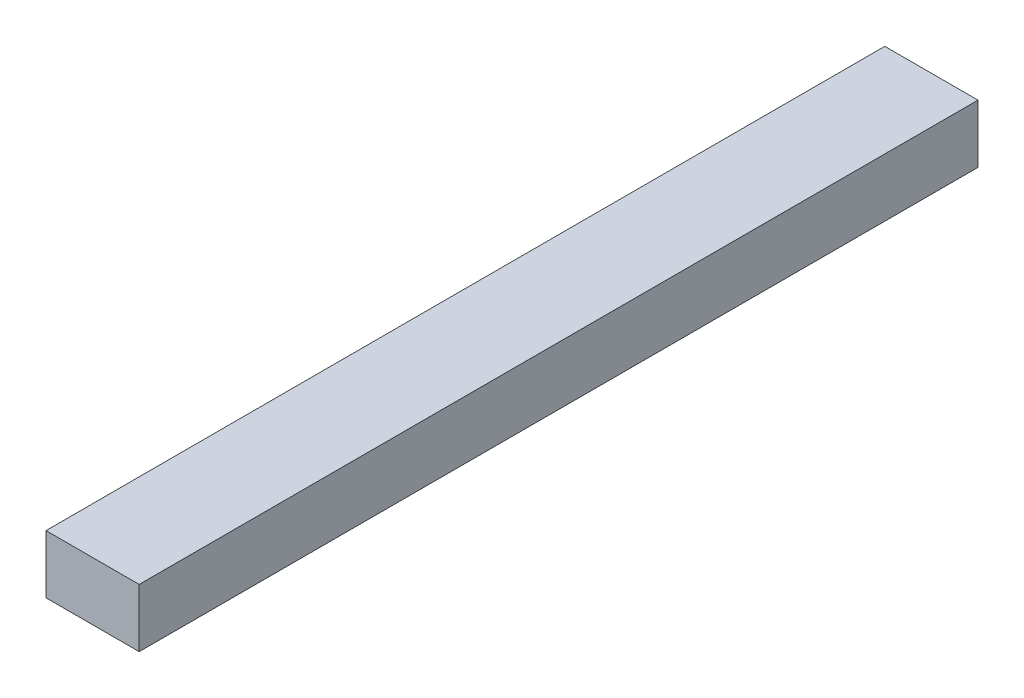
ISO-10303-21;
HEADER;
FILE_DESCRIPTION(('STEP AP214'),'2;1');
FILE_NAME('part.step','',(''),(''),'','','');
FILE_SCHEMA(('AUTOMOTIVE_DESIGN { 1 0 10303 214 1 1 1 1 }'));
ENDSEC;
DATA;
#1=APPLICATION_CONTEXT('core data for automotive mechanical design processes');
#2=APPLICATION_PROTOCOL_DEFINITION('international standard','automotive_design',2000,#1);
#3=PRODUCT_CONTEXT('',#1,'mechanical');
#4=PRODUCT('Part','Part','',(#3));
#5=PRODUCT_RELATED_PRODUCT_CATEGORY('part','',(#4));
#6=PRODUCT_DEFINITION_FORMATION('','',#4);
#7=PRODUCT_DEFINITION_CONTEXT('part definition',#1,'design');
#8=PRODUCT_DEFINITION('design','',#6,#7);
#9=PRODUCT_DEFINITION_SHAPE('','',#8);
#10=(LENGTH_UNIT() NAMED_UNIT(*) SI_UNIT(.MILLI.,.METRE.));
#11=(NAMED_UNIT(*) PLANE_ANGLE_UNIT() SI_UNIT($,.RADIAN.));
#12=(NAMED_UNIT(*) SI_UNIT($,.STERADIAN.) SOLID_ANGLE_UNIT());
#13=UNCERTAINTY_MEASURE_WITH_UNIT(LENGTH_MEASURE(1.E-05),#10,'distance_accuracy_value','');
#14=(GEOMETRIC_REPRESENTATION_CONTEXT(3) GLOBAL_UNCERTAINTY_ASSIGNED_CONTEXT((#13)) GLOBAL_UNIT_ASSIGNED_CONTEXT((#10,
#11,#12)) REPRESENTATION_CONTEXT('',''));
#15=CARTESIAN_POINT('',(0.,0.,0.));
#16=DIRECTION('',(0.,0.,1.));
#17=DIRECTION('',(1.,0.,0.));
#18=AXIS2_PLACEMENT_3D('',#15,#16,#17);
#19=CARTESIAN_POINT('',(-12.7,-7.93749999999994,114.3));
#20=DIRECTION('',(1.,0.,0.));
#21=DIRECTION('',(0.,0.,-1.));
#22=AXIS2_PLACEMENT_3D('',#19,#20,#21);
#23=PLANE('',#22);
#24=DIRECTION('',(0.,-1.,0.));
#25=VECTOR('',#24,1.);
#26=CARTESIAN_POINT('',(-12.7,-7.93750000000001,-114.3));
#27=LINE('',#26,#25);
#28=CARTESIAN_POINT('',(-12.7,7.93749999999998,-114.3));
#29=VERTEX_POINT('',#28);
#30=CARTESIAN_POINT('',(-12.7,-7.93750000000001,-114.3));
#31=VERTEX_POINT('',#30);
#32=EDGE_CURVE('E111',#29,#31,#27,.T.);
#33=ORIENTED_EDGE('',*,*,#32,.T.);
#34=DIRECTION('',(0.,0.,-1.));
#35=VECTOR('',#34,1.);
#36=CARTESIAN_POINT('',(-12.7,-7.93749999999994,114.3));
#37=LINE('',#36,#35);
#38=CARTESIAN_POINT('',(-12.7,-7.93749999999994,114.3));
#39=VERTEX_POINT('',#38);
#40=EDGE_CURVE('E13',#39,#31,#37,.T.);
#41=ORIENTED_EDGE('',*,*,#40,.F.);
#42=DIRECTION('',(0.,-1.,0.));
#43=VECTOR('',#42,1.);
#44=CARTESIAN_POINT('',(-12.7,-7.93749999999994,114.3));
#45=LINE('',#44,#43);
#46=CARTESIAN_POINT('',(-12.7,7.93750000000002,114.3));
#47=VERTEX_POINT('',#46);
#48=EDGE_CURVE('E99',#47,#39,#45,.T.);
#49=ORIENTED_EDGE('',*,*,#48,.F.);
#50=DIRECTION('',(0.,0.,-1.));
#51=VECTOR('',#50,1.);
#52=CARTESIAN_POINT('',(-12.7,7.93750000000002,114.3));
#53=LINE('',#52,#51);
#54=EDGE_CURVE('E107',#47,#29,#53,.T.);
#55=ORIENTED_EDGE('',*,*,#54,.T.);
#56=EDGE_LOOP('',(#33,#41,#49,#55));
#57=FACE_BOUND('',#56,.T.);
#58=ADVANCED_FACE('F48',(#57),#23,.F.);
#59=CARTESIAN_POINT('',(12.7,-7.93749999999994,114.3));
#60=DIRECTION('',(0.,1.,0.));
#61=DIRECTION('',(-1.,0.,0.));
#62=AXIS2_PLACEMENT_3D('',#59,#60,#61);
#63=PLANE('',#62);
#64=DIRECTION('',(1.,0.,0.));
#65=VECTOR('',#64,1.);
#66=CARTESIAN_POINT('',(12.7,-7.93750000000001,-114.3));
#67=LINE('',#66,#65);
#68=CARTESIAN_POINT('',(12.7,-7.93750000000001,-114.3));
#69=VERTEX_POINT('',#68);
#70=EDGE_CURVE('E103',#31,#69,#67,.T.);
#71=ORIENTED_EDGE('',*,*,#70,.T.);
#72=DIRECTION('',(0.,0.,-1.));
#73=VECTOR('',#72,1.);
#74=CARTESIAN_POINT('',(12.7,-7.93749999999994,114.3));
#75=LINE('',#74,#73);
#76=CARTESIAN_POINT('',(12.7,-7.93749999999994,114.3));
#77=VERTEX_POINT('',#76);
#78=EDGE_CURVE('E56',#77,#69,#75,.T.);
#79=ORIENTED_EDGE('',*,*,#78,.F.);
#80=DIRECTION('',(1.,0.,0.));
#81=VECTOR('',#80,1.);
#82=CARTESIAN_POINT('',(12.7,-7.93749999999994,114.3));
#83=LINE('',#82,#81);
#84=EDGE_CURVE('E94',#39,#77,#83,.T.);
#85=ORIENTED_EDGE('',*,*,#84,.F.);
#86=ORIENTED_EDGE('',*,*,#40,.T.);
#87=EDGE_LOOP('',(#71,#79,#85,#86));
#88=FACE_BOUND('',#87,.T.);
#89=ADVANCED_FACE('F102',(#88),#63,.F.);
#90=CARTESIAN_POINT('',(12.7,-7.93749999999994,114.3));
#91=DIRECTION('',(-1.,0.,0.));
#92=DIRECTION('',(0.,0.,1.));
#93=AXIS2_PLACEMENT_3D('',#90,#91,#92);
#94=PLANE('',#93);
#95=DIRECTION('',(0.,1.,0.));
#96=VECTOR('',#95,1.);
#97=CARTESIAN_POINT('',(12.7,-7.93750000000001,-114.3));
#98=LINE('',#97,#96);
#99=CARTESIAN_POINT('',(12.7,7.93749999999999,-114.3));
#100=VERTEX_POINT('',#99);
#101=EDGE_CURVE('E81',#69,#100,#98,.T.);
#102=ORIENTED_EDGE('',*,*,#101,.T.);
#103=DIRECTION('',(0.,0.,-1.));
#104=VECTOR('',#103,1.);
#105=CARTESIAN_POINT('',(12.7,7.93750000000003,114.3));
#106=LINE('',#105,#104);
#107=CARTESIAN_POINT('',(12.7,7.93750000000003,114.3));
#108=VERTEX_POINT('',#107);
#109=EDGE_CURVE('E104',#108,#100,#106,.T.);
#110=ORIENTED_EDGE('',*,*,#109,.F.);
#111=DIRECTION('',(0.,1.,0.));
#112=VECTOR('',#111,1.);
#113=CARTESIAN_POINT('',(12.7,-7.93749999999994,114.3));
#114=LINE('',#113,#112);
#115=EDGE_CURVE('E97',#77,#108,#114,.T.);
#116=ORIENTED_EDGE('',*,*,#115,.F.);
#117=ORIENTED_EDGE('',*,*,#78,.T.);
#118=EDGE_LOOP('',(#102,#110,#116,#117));
#119=FACE_BOUND('',#118,.T.);
#120=ADVANCED_FACE('F105',(#119),#94,.F.);
#121=CARTESIAN_POINT('',(12.7,7.93750000000003,114.3));
#122=DIRECTION('',(0.,-1.,0.));
#123=DIRECTION('',(1.,0.,0.));
#124=AXIS2_PLACEMENT_3D('',#121,#122,#123);
#125=PLANE('',#124);
#126=DIRECTION('',(-1.,0.,0.));
#127=VECTOR('',#126,1.);
#128=CARTESIAN_POINT('',(12.7,7.93749999999999,-114.3));
#129=LINE('',#128,#127);
#130=EDGE_CURVE('E87',#100,#29,#129,.T.);
#131=ORIENTED_EDGE('',*,*,#130,.T.);
#132=ORIENTED_EDGE('',*,*,#54,.F.);
#133=DIRECTION('',(-1.,0.,0.));
#134=VECTOR('',#133,1.);
#135=CARTESIAN_POINT('',(12.7,7.93750000000003,114.3));
#136=LINE('',#135,#134);
#137=EDGE_CURVE('E64',#108,#47,#136,.T.);
#138=ORIENTED_EDGE('',*,*,#137,.F.);
#139=ORIENTED_EDGE('',*,*,#109,.T.);
#140=EDGE_LOOP('',(#131,#132,#138,#139));
#141=FACE_BOUND('',#140,.T.);
#142=ADVANCED_FACE('F119',(#141),#125,.F.);
#143=CARTESIAN_POINT('',(0.,0.,114.3));
#144=DIRECTION('',(0.,0.,1.));
#145=DIRECTION('',(1.,0.,0.));
#146=AXIS2_PLACEMENT_3D('',#143,#144,#145);
#147=PLANE('',#146);
#148=ORIENTED_EDGE('',*,*,#48,.T.);
#149=ORIENTED_EDGE('',*,*,#84,.T.);
#150=ORIENTED_EDGE('',*,*,#115,.T.);
#151=ORIENTED_EDGE('',*,*,#137,.T.);
#152=EDGE_LOOP('',(#148,#149,#150,#151));
#153=FACE_BOUND('',#152,.T.);
#154=ADVANCED_FACE('F95',(#153),#147,.T.);
#155=CARTESIAN_POINT('',(0.,0.,-114.3));
#156=DIRECTION('',(0.,0.,1.));
#157=DIRECTION('',(1.,0.,0.));
#158=AXIS2_PLACEMENT_3D('',#155,#156,#157);
#159=PLANE('',#158);
#160=CARTESIAN_POINT('',(0.,0.,-114.3));
#161=DIRECTION('',(0.,0.,-1.));
#162=DIRECTION('',(-1.,0.,0.));
#163=AXIS2_PLACEMENT_3D('',#160,#161,#162);
#164=CIRCLE('',#163,5.35813);
#165=CARTESIAN_POINT('',(-5.35813,0.,-114.3));
#166=VERTEX_POINT('',#165);
#167=EDGE_CURVE('E127',#166,#166,#164,.T.);
#168=ORIENTED_EDGE('',*,*,#167,.F.);
#169=EDGE_LOOP('',(#168));
#170=FACE_BOUND('',#169,.T.);
#171=ORIENTED_EDGE('',*,*,#32,.F.);
#172=ORIENTED_EDGE('',*,*,#130,.F.);
#173=ORIENTED_EDGE('',*,*,#101,.F.);
#174=ORIENTED_EDGE('',*,*,#70,.F.);
#175=EDGE_LOOP('',(#171,#172,#173,#174));
#176=FACE_BOUND('',#175,.T.);
#177=ADVANCED_FACE('F122',(#170,#176),#159,.F.);
#178=CARTESIAN_POINT('',(0.,0.,-83.058));
#179=DIRECTION('',(0.,0.,1.));
#180=DIRECTION('',(1.,0.,0.));
#181=AXIS2_PLACEMENT_3D('',#178,#179,#180);
#182=PLANE('',#181);
#183=CARTESIAN_POINT('',(0.,0.,-83.058));
#184=DIRECTION('',(0.,0.,-1.));
#185=DIRECTION('',(-1.,0.,0.));
#186=AXIS2_PLACEMENT_3D('',#183,#184,#185);
#187=CIRCLE('',#186,5.35812999999999);
#188=CARTESIAN_POINT('',(-5.35813000000001,0.,-83.058));
#189=VERTEX_POINT('',#188);
#190=EDGE_CURVE('E114',#189,#189,#187,.T.);
#191=ORIENTED_EDGE('',*,*,#190,.T.);
#192=EDGE_LOOP('',(#191));
#193=FACE_BOUND('',#192,.T.);
#194=ADVANCED_FACE('F134',(#193),#182,.F.);
#195=CARTESIAN_POINT('',(0.,0.,-114.3));
#196=DIRECTION('',(0.,0.,-1.));
#197=DIRECTION('',(-1.,0.,0.));
#198=AXIS2_PLACEMENT_3D('',#195,#196,#197);
#199=CYLINDRICAL_SURFACE('',#198,5.35813);
#200=ORIENTED_EDGE('',*,*,#190,.F.);
#201=EDGE_LOOP('',(#200));
#202=FACE_BOUND('',#201,.T.);
#203=ORIENTED_EDGE('',*,*,#167,.T.);
#204=EDGE_LOOP('',(#203));
#205=FACE_BOUND('',#204,.T.);
#206=ADVANCED_FACE('F131',(#202,#205),#199,.F.);
#207=CLOSED_SHELL('',(#58,#89,#120,#142,#154,#177,#194,#206));
#208=MANIFOLD_SOLID_BREP('B2',#207);
#209=ADVANCED_BREP_SHAPE_REPRESENTATION('',(#18,#208),#14);
#210=SHAPE_DEFINITION_REPRESENTATION(#9,#209);
ENDSEC;
END-ISO-10303-21;
